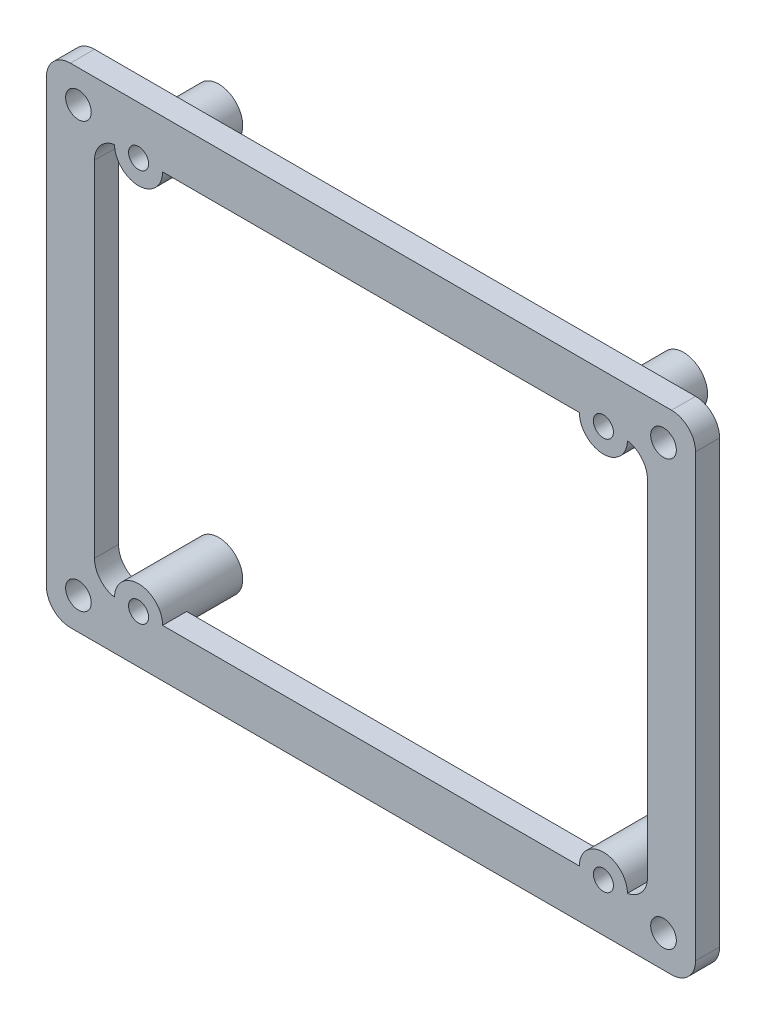
ISO-10303-21;
HEADER;
FILE_DESCRIPTION(('STEP AP214'),'2;1');
FILE_NAME('part.step','',(''),(''),'','','');
FILE_SCHEMA(('AUTOMOTIVE_DESIGN { 1 0 10303 214 1 1 1 1 }'));
ENDSEC;
DATA;
#1=APPLICATION_CONTEXT('core data for automotive mechanical design processes');
#2=APPLICATION_PROTOCOL_DEFINITION('international standard','automotive_design',2000,#1);
#3=PRODUCT_CONTEXT('',#1,'mechanical');
#4=PRODUCT('Part','Part','',(#3));
#5=PRODUCT_RELATED_PRODUCT_CATEGORY('part','',(#4));
#6=PRODUCT_DEFINITION_FORMATION('','',#4);
#7=PRODUCT_DEFINITION_CONTEXT('part definition',#1,'design');
#8=PRODUCT_DEFINITION('design','',#6,#7);
#9=PRODUCT_DEFINITION_SHAPE('','',#8);
#10=(LENGTH_UNIT() NAMED_UNIT(*) SI_UNIT(.MILLI.,.METRE.));
#11=(NAMED_UNIT(*) PLANE_ANGLE_UNIT() SI_UNIT($,.RADIAN.));
#12=(NAMED_UNIT(*) SI_UNIT($,.STERADIAN.) SOLID_ANGLE_UNIT());
#13=UNCERTAINTY_MEASURE_WITH_UNIT(LENGTH_MEASURE(1.E-05),#10,'distance_accuracy_value','');
#14=(GEOMETRIC_REPRESENTATION_CONTEXT(3) GLOBAL_UNCERTAINTY_ASSIGNED_CONTEXT((#13)) GLOBAL_UNIT_ASSIGNED_CONTEXT((#10,
#11,#12)) REPRESENTATION_CONTEXT('',''));
#15=CARTESIAN_POINT('',(0.,0.,0.));
#16=DIRECTION('',(0.,0.,1.));
#17=DIRECTION('',(1.,0.,0.));
#18=AXIS2_PLACEMENT_3D('',#15,#16,#17);
#19=CARTESIAN_POINT('',(0.,0.,3.));
#20=DIRECTION('',(0.,0.,1.));
#21=DIRECTION('',(1.,0.,0.));
#22=AXIS2_PLACEMENT_3D('',#19,#20,#21);
#23=PLANE('',#22);
#24=CARTESIAN_POINT('',(-29.,24.5,3.));
#25=DIRECTION('',(0.,0.,1.));
#26=DIRECTION('',(1.,0.,0.));
#27=AXIS2_PLACEMENT_3D('',#24,#25,#26);
#28=CIRCLE('',#27,1.25);
#29=CARTESIAN_POINT('',(-27.75,24.5,3.));
#30=VERTEX_POINT('',#29);
#31=EDGE_CURVE('E665',#30,#30,#28,.F.);
#32=ORIENTED_EDGE('',*,*,#31,.T.);
#33=EDGE_LOOP('',(#32));
#34=FACE_BOUND('',#33,.T.);
#35=CARTESIAN_POINT('',(29.,-24.5,3.));
#36=DIRECTION('',(0.,0.,1.));
#37=DIRECTION('',(1.,0.,0.));
#38=AXIS2_PLACEMENT_3D('',#35,#36,#37);
#39=CIRCLE('',#38,1.25);
#40=CARTESIAN_POINT('',(30.25,-24.5,3.));
#41=VERTEX_POINT('',#40);
#42=EDGE_CURVE('E666',#41,#41,#39,.F.);
#43=ORIENTED_EDGE('',*,*,#42,.T.);
#44=EDGE_LOOP('',(#43));
#45=FACE_BOUND('',#44,.T.);
#46=CARTESIAN_POINT('',(-29.,-24.5,3.));
#47=DIRECTION('',(0.,0.,1.));
#48=DIRECTION('',(1.,0.,0.));
#49=AXIS2_PLACEMENT_3D('',#46,#47,#48);
#50=CIRCLE('',#49,1.25);
#51=CARTESIAN_POINT('',(-27.75,-24.5,3.));
#52=VERTEX_POINT('',#51);
#53=EDGE_CURVE('E673',#52,#52,#50,.F.);
#54=ORIENTED_EDGE('',*,*,#53,.T.);
#55=EDGE_LOOP('',(#54));
#56=FACE_BOUND('',#55,.T.);
#57=CARTESIAN_POINT('',(29.,24.5,3.));
#58=DIRECTION('',(0.,0.,1.));
#59=DIRECTION('',(1.,0.,0.));
#60=AXIS2_PLACEMENT_3D('',#57,#58,#59);
#61=CIRCLE('',#60,1.25);
#62=CARTESIAN_POINT('',(30.25,24.5,3.));
#63=VERTEX_POINT('',#62);
#64=EDGE_CURVE('E197',#63,#63,#61,.F.);
#65=ORIENTED_EDGE('',*,*,#64,.T.);
#66=EDGE_LOOP('',(#65));
#67=FACE_BOUND('',#66,.T.);
#68=DIRECTION('',(1.,0.,0.));
#69=VECTOR('',#68,1.);
#70=CARTESIAN_POINT('',(0.,-24.5,3.));
#71=LINE('',#70,#69);
#72=CARTESIAN_POINT('',(-26.,-24.5,3.));
#73=VERTEX_POINT('',#72);
#74=CARTESIAN_POINT('',(26.,-24.5,3.));
#75=VERTEX_POINT('',#74);
#76=EDGE_CURVE('E203',#73,#75,#71,.T.);
#77=ORIENTED_EDGE('',*,*,#76,.F.);
#78=CARTESIAN_POINT('',(-29.,-24.5,3.));
#79=DIRECTION('',(0.,0.,1.));
#80=DIRECTION('',(1.,0.,0.));
#81=AXIS2_PLACEMENT_3D('',#78,#79,#80);
#82=CIRCLE('',#81,3.);
#83=CARTESIAN_POINT('',(-31.9997072354643,-24.4580893628869,3.));
#84=VERTEX_POINT('',#83);
#85=EDGE_CURVE('E72',#73,#84,#82,.T.);
#86=ORIENTED_EDGE('',*,*,#85,.T.);
#87=CARTESIAN_POINT('',(-31.5,-21.5,3.));
#88=DIRECTION('',(0.,0.,1.));
#89=DIRECTION('',(1.,0.,0.));
#90=AXIS2_PLACEMENT_3D('',#87,#88,#89);
#91=CIRCLE('',#90,3.);
#92=CARTESIAN_POINT('',(-34.5,-21.5,3.));
#93=VERTEX_POINT('',#92);
#94=EDGE_CURVE('E317',#84,#93,#91,.F.);
#95=ORIENTED_EDGE('',*,*,#94,.T.);
#96=DIRECTION('',(0.,-1.,0.));
#97=VECTOR('',#96,1.);
#98=CARTESIAN_POINT('',(-34.5,0.,3.));
#99=LINE('',#98,#97);
#100=CARTESIAN_POINT('',(-34.5,21.5,3.));
#101=VERTEX_POINT('',#100);
#102=EDGE_CURVE('E213',#101,#93,#99,.T.);
#103=ORIENTED_EDGE('',*,*,#102,.F.);
#104=CARTESIAN_POINT('',(-31.5,21.5,3.));
#105=DIRECTION('',(0.,0.,1.));
#106=DIRECTION('',(1.,0.,0.));
#107=AXIS2_PLACEMENT_3D('',#104,#105,#106);
#108=CIRCLE('',#107,3.);
#109=CARTESIAN_POINT('',(-31.9997072354643,24.4580893628869,3.));
#110=VERTEX_POINT('',#109);
#111=EDGE_CURVE('E321',#101,#110,#108,.F.);
#112=ORIENTED_EDGE('',*,*,#111,.T.);
#113=CARTESIAN_POINT('',(-29.,24.5,3.));
#114=DIRECTION('',(0.,0.,1.));
#115=DIRECTION('',(1.,0.,0.));
#116=AXIS2_PLACEMENT_3D('',#113,#114,#115);
#117=CIRCLE('',#116,3.);
#118=CARTESIAN_POINT('',(-26.,24.5,3.));
#119=VERTEX_POINT('',#118);
#120=EDGE_CURVE('E355',#110,#119,#117,.T.);
#121=ORIENTED_EDGE('',*,*,#120,.T.);
#122=DIRECTION('',(-1.,0.,0.));
#123=VECTOR('',#122,1.);
#124=CARTESIAN_POINT('',(0.,24.5,3.));
#125=LINE('',#124,#123);
#126=CARTESIAN_POINT('',(26.,24.5,3.));
#127=VERTEX_POINT('',#126);
#128=EDGE_CURVE('E216',#127,#119,#125,.T.);
#129=ORIENTED_EDGE('',*,*,#128,.F.);
#130=CARTESIAN_POINT('',(29.,24.5,3.));
#131=DIRECTION('',(0.,0.,1.));
#132=DIRECTION('',(1.,0.,0.));
#133=AXIS2_PLACEMENT_3D('',#130,#131,#132);
#134=CIRCLE('',#133,3.);
#135=CARTESIAN_POINT('',(31.9997072354643,24.4580893628869,3.));
#136=VERTEX_POINT('',#135);
#137=EDGE_CURVE('E79',#127,#136,#134,.T.);
#138=ORIENTED_EDGE('',*,*,#137,.T.);
#139=CARTESIAN_POINT('',(31.5,21.5,3.));
#140=DIRECTION('',(0.,0.,1.));
#141=DIRECTION('',(1.,0.,0.));
#142=AXIS2_PLACEMENT_3D('',#139,#140,#141);
#143=CIRCLE('',#142,3.);
#144=CARTESIAN_POINT('',(34.5,21.5,3.));
#145=VERTEX_POINT('',#144);
#146=EDGE_CURVE('E312',#136,#145,#143,.F.);
#147=ORIENTED_EDGE('',*,*,#146,.T.);
#148=DIRECTION('',(0.,1.,0.));
#149=VECTOR('',#148,1.);
#150=CARTESIAN_POINT('',(34.5,0.,3.));
#151=LINE('',#150,#149);
#152=CARTESIAN_POINT('',(34.5,-21.5,3.));
#153=VERTEX_POINT('',#152);
#154=EDGE_CURVE('E212',#153,#145,#151,.T.);
#155=ORIENTED_EDGE('',*,*,#154,.F.);
#156=CARTESIAN_POINT('',(31.5,-21.5,3.));
#157=DIRECTION('',(0.,0.,1.));
#158=DIRECTION('',(1.,0.,0.));
#159=AXIS2_PLACEMENT_3D('',#156,#157,#158);
#160=CIRCLE('',#159,3.);
#161=CARTESIAN_POINT('',(31.9997072354643,-24.4580893628869,3.));
#162=VERTEX_POINT('',#161);
#163=EDGE_CURVE('E307',#153,#162,#160,.F.);
#164=ORIENTED_EDGE('',*,*,#163,.T.);
#165=CARTESIAN_POINT('',(29.,-24.5,3.));
#166=DIRECTION('',(0.,0.,1.));
#167=DIRECTION('',(1.,0.,0.));
#168=AXIS2_PLACEMENT_3D('',#165,#166,#167);
#169=CIRCLE('',#168,3.);
#170=EDGE_CURVE('E206',#162,#75,#169,.T.);
#171=ORIENTED_EDGE('',*,*,#170,.T.);
#172=EDGE_LOOP('',(#77,#86,#95,#103,#112,#121,#129,#138,#147,#155,#164,#171));
#173=FACE_BOUND('',#172,.T.);
#174=CARTESIAN_POINT('',(-36.5,-26.5,3.));
#175=DIRECTION('',(0.,0.,1.));
#176=DIRECTION('',(1.,0.,0.));
#177=AXIS2_PLACEMENT_3D('',#174,#175,#176);
#178=CIRCLE('',#177,1.6);
#179=CARTESIAN_POINT('',(-34.9,-26.5,3.));
#180=VERTEX_POINT('',#179);
#181=EDGE_CURVE('E378',#180,#180,#178,.T.);
#182=ORIENTED_EDGE('',*,*,#181,.F.);
#183=EDGE_LOOP('',(#182));
#184=FACE_BOUND('',#183,.T.);
#185=CARTESIAN_POINT('',(36.5,-26.5,3.));
#186=DIRECTION('',(0.,0.,1.));
#187=DIRECTION('',(1.,0.,0.));
#188=AXIS2_PLACEMENT_3D('',#185,#186,#187);
#189=CIRCLE('',#188,1.6);
#190=CARTESIAN_POINT('',(38.1,-26.5,3.));
#191=VERTEX_POINT('',#190);
#192=EDGE_CURVE('E387',#191,#191,#189,.T.);
#193=ORIENTED_EDGE('',*,*,#192,.F.);
#194=EDGE_LOOP('',(#193));
#195=FACE_BOUND('',#194,.T.);
#196=CARTESIAN_POINT('',(36.5,26.5,3.));
#197=DIRECTION('',(0.,0.,1.));
#198=DIRECTION('',(1.,0.,0.));
#199=AXIS2_PLACEMENT_3D('',#196,#197,#198);
#200=CIRCLE('',#199,1.6);
#201=CARTESIAN_POINT('',(38.1,26.5,3.));
#202=VERTEX_POINT('',#201);
#203=EDGE_CURVE('E379',#202,#202,#200,.T.);
#204=ORIENTED_EDGE('',*,*,#203,.F.);
#205=EDGE_LOOP('',(#204));
#206=FACE_BOUND('',#205,.T.);
#207=CARTESIAN_POINT('',(-36.5,26.5,3.));
#208=DIRECTION('',(0.,0.,1.));
#209=DIRECTION('',(1.,0.,0.));
#210=AXIS2_PLACEMENT_3D('',#207,#208,#209);
#211=CIRCLE('',#210,1.6);
#212=CARTESIAN_POINT('',(-34.9,26.5,3.));
#213=VERTEX_POINT('',#212);
#214=EDGE_CURVE('E386',#213,#213,#211,.T.);
#215=ORIENTED_EDGE('',*,*,#214,.F.);
#216=EDGE_LOOP('',(#215));
#217=FACE_BOUND('',#216,.T.);
#218=DIRECTION('',(0.,1.,0.));
#219=VECTOR('',#218,1.);
#220=CARTESIAN_POINT('',(40.5,0.,3.));
#221=LINE('',#220,#219);
#222=CARTESIAN_POINT('',(40.5,-27.5,3.));
#223=VERTEX_POINT('',#222);
#224=CARTESIAN_POINT('',(40.5,27.5,3.));
#225=VERTEX_POINT('',#224);
#226=EDGE_CURVE('E243',#223,#225,#221,.T.);
#227=ORIENTED_EDGE('',*,*,#226,.T.);
#228=CARTESIAN_POINT('',(37.5,27.5,3.));
#229=DIRECTION('',(0.,0.,1.));
#230=DIRECTION('',(1.,0.,0.));
#231=AXIS2_PLACEMENT_3D('',#228,#229,#230);
#232=CIRCLE('',#231,3.);
#233=CARTESIAN_POINT('',(37.5,30.5,3.));
#234=VERTEX_POINT('',#233);
#235=EDGE_CURVE('E293',#225,#234,#232,.T.);
#236=ORIENTED_EDGE('',*,*,#235,.T.);
#237=DIRECTION('',(-1.,0.,0.));
#238=VECTOR('',#237,1.);
#239=CARTESIAN_POINT('',(0.,30.5,3.));
#240=LINE('',#239,#238);
#241=CARTESIAN_POINT('',(-37.5,30.5,3.));
#242=VERTEX_POINT('',#241);
#243=EDGE_CURVE('E246',#234,#242,#240,.T.);
#244=ORIENTED_EDGE('',*,*,#243,.T.);
#245=CARTESIAN_POINT('',(-37.5,27.5,3.));
#246=DIRECTION('',(0.,0.,1.));
#247=DIRECTION('',(1.,0.,0.));
#248=AXIS2_PLACEMENT_3D('',#245,#246,#247);
#249=CIRCLE('',#248,3.);
#250=CARTESIAN_POINT('',(-40.5,27.5,3.));
#251=VERTEX_POINT('',#250);
#252=EDGE_CURVE('E287',#242,#251,#249,.T.);
#253=ORIENTED_EDGE('',*,*,#252,.T.);
#254=DIRECTION('',(0.,-1.,0.));
#255=VECTOR('',#254,1.);
#256=CARTESIAN_POINT('',(-40.5,0.,3.));
#257=LINE('',#256,#255);
#258=CARTESIAN_POINT('',(-40.5,-27.5,3.));
#259=VERTEX_POINT('',#258);
#260=EDGE_CURVE('E236',#251,#259,#257,.T.);
#261=ORIENTED_EDGE('',*,*,#260,.T.);
#262=CARTESIAN_POINT('',(-37.5,-27.5,3.));
#263=DIRECTION('',(0.,0.,1.));
#264=DIRECTION('',(1.,0.,0.));
#265=AXIS2_PLACEMENT_3D('',#262,#263,#264);
#266=CIRCLE('',#265,3.);
#267=CARTESIAN_POINT('',(-37.5,-30.5,3.));
#268=VERTEX_POINT('',#267);
#269=EDGE_CURVE('E289',#259,#268,#266,.T.);
#270=ORIENTED_EDGE('',*,*,#269,.T.);
#271=DIRECTION('',(1.,0.,0.));
#272=VECTOR('',#271,1.);
#273=CARTESIAN_POINT('',(0.,-30.5,3.));
#274=LINE('',#273,#272);
#275=CARTESIAN_POINT('',(37.5,-30.5,3.));
#276=VERTEX_POINT('',#275);
#277=EDGE_CURVE('E239',#268,#276,#274,.T.);
#278=ORIENTED_EDGE('',*,*,#277,.T.);
#279=CARTESIAN_POINT('',(37.5,-27.5,3.));
#280=DIRECTION('',(0.,0.,1.));
#281=DIRECTION('',(1.,0.,0.));
#282=AXIS2_PLACEMENT_3D('',#279,#280,#281);
#283=CIRCLE('',#282,3.);
#284=EDGE_CURVE('E291',#276,#223,#283,.T.);
#285=ORIENTED_EDGE('',*,*,#284,.T.);
#286=EDGE_LOOP('',(#227,#236,#244,#253,#261,#270,#278,#285));
#287=FACE_BOUND('',#286,.T.);
#288=ADVANCED_FACE('F57',(#34,#45,#56,#67,#173,#184,#195,#206,#217,#287),#23,.T.);
#289=CARTESIAN_POINT('',(0.,0.,0.));
#290=DIRECTION('',(0.,0.,1.));
#291=DIRECTION('',(1.,0.,0.));
#292=AXIS2_PLACEMENT_3D('',#289,#290,#291);
#293=PLANE('',#292);
#294=CARTESIAN_POINT('',(-36.5,-26.5,0.));
#295=DIRECTION('',(0.,0.,1.));
#296=DIRECTION('',(1.,0.,0.));
#297=AXIS2_PLACEMENT_3D('',#294,#295,#296);
#298=CIRCLE('',#297,1.6);
#299=CARTESIAN_POINT('',(-34.9,-26.5,0.));
#300=VERTEX_POINT('',#299);
#301=EDGE_CURVE('E390',#300,#300,#298,.F.);
#302=ORIENTED_EDGE('',*,*,#301,.F.);
#303=EDGE_LOOP('',(#302));
#304=FACE_BOUND('',#303,.T.);
#305=CARTESIAN_POINT('',(36.5,-26.5,0.));
#306=DIRECTION('',(0.,0.,1.));
#307=DIRECTION('',(1.,0.,0.));
#308=AXIS2_PLACEMENT_3D('',#305,#306,#307);
#309=CIRCLE('',#308,1.6);
#310=CARTESIAN_POINT('',(38.1,-26.5,0.));
#311=VERTEX_POINT('',#310);
#312=EDGE_CURVE('E383',#311,#311,#309,.F.);
#313=ORIENTED_EDGE('',*,*,#312,.F.);
#314=EDGE_LOOP('',(#313));
#315=FACE_BOUND('',#314,.T.);
#316=CARTESIAN_POINT('',(36.5,26.5,0.));
#317=DIRECTION('',(0.,0.,1.));
#318=DIRECTION('',(1.,0.,0.));
#319=AXIS2_PLACEMENT_3D('',#316,#317,#318);
#320=CIRCLE('',#319,1.6);
#321=CARTESIAN_POINT('',(38.1,26.5,0.));
#322=VERTEX_POINT('',#321);
#323=EDGE_CURVE('E382',#322,#322,#320,.F.);
#324=ORIENTED_EDGE('',*,*,#323,.F.);
#325=EDGE_LOOP('',(#324));
#326=FACE_BOUND('',#325,.T.);
#327=CARTESIAN_POINT('',(-36.5,26.5,0.));
#328=DIRECTION('',(0.,0.,1.));
#329=DIRECTION('',(1.,0.,0.));
#330=AXIS2_PLACEMENT_3D('',#327,#328,#329);
#331=CIRCLE('',#330,1.6);
#332=CARTESIAN_POINT('',(-34.9,26.5,0.));
#333=VERTEX_POINT('',#332);
#334=EDGE_CURVE('E229',#333,#333,#331,.F.);
#335=ORIENTED_EDGE('',*,*,#334,.F.);
#336=EDGE_LOOP('',(#335));
#337=FACE_BOUND('',#336,.T.);
#338=DIRECTION('',(-1.,0.,0.));
#339=VECTOR('',#338,1.);
#340=CARTESIAN_POINT('',(0.,30.5,0.));
#341=LINE('',#340,#339);
#342=CARTESIAN_POINT('',(37.5,30.5,0.));
#343=VERTEX_POINT('',#342);
#344=CARTESIAN_POINT('',(-37.5,30.5,0.));
#345=VERTEX_POINT('',#344);
#346=EDGE_CURVE('E240',#343,#345,#341,.T.);
#347=ORIENTED_EDGE('',*,*,#346,.F.);
#348=CARTESIAN_POINT('',(37.5,27.5,0.));
#349=DIRECTION('',(0.,0.,1.));
#350=DIRECTION('',(1.,0.,0.));
#351=AXIS2_PLACEMENT_3D('',#348,#349,#350);
#352=CIRCLE('',#351,3.);
#353=CARTESIAN_POINT('',(40.5,27.5,0.));
#354=VERTEX_POINT('',#353);
#355=EDGE_CURVE('E280',#343,#354,#352,.F.);
#356=ORIENTED_EDGE('',*,*,#355,.T.);
#357=DIRECTION('',(0.,1.,0.));
#358=VECTOR('',#357,1.);
#359=CARTESIAN_POINT('',(40.5,0.,0.));
#360=LINE('',#359,#358);
#361=CARTESIAN_POINT('',(40.5,-27.5,0.));
#362=VERTEX_POINT('',#361);
#363=EDGE_CURVE('E255',#362,#354,#360,.T.);
#364=ORIENTED_EDGE('',*,*,#363,.F.);
#365=CARTESIAN_POINT('',(37.5,-27.5,0.));
#366=DIRECTION('',(0.,0.,1.));
#367=DIRECTION('',(1.,0.,0.));
#368=AXIS2_PLACEMENT_3D('',#365,#366,#367);
#369=CIRCLE('',#368,3.);
#370=CARTESIAN_POINT('',(37.5,-30.5,0.));
#371=VERTEX_POINT('',#370);
#372=EDGE_CURVE('E278',#362,#371,#369,.F.);
#373=ORIENTED_EDGE('',*,*,#372,.T.);
#374=DIRECTION('',(1.,0.,0.));
#375=VECTOR('',#374,1.);
#376=CARTESIAN_POINT('',(0.,-30.5,0.));
#377=LINE('',#376,#375);
#378=CARTESIAN_POINT('',(-37.5,-30.5,0.));
#379=VERTEX_POINT('',#378);
#380=EDGE_CURVE('E252',#379,#371,#377,.T.);
#381=ORIENTED_EDGE('',*,*,#380,.F.);
#382=CARTESIAN_POINT('',(-37.5,-27.5,0.));
#383=DIRECTION('',(0.,0.,1.));
#384=DIRECTION('',(1.,0.,0.));
#385=AXIS2_PLACEMENT_3D('',#382,#383,#384);
#386=CIRCLE('',#385,3.);
#387=CARTESIAN_POINT('',(-40.5,-27.5,0.));
#388=VERTEX_POINT('',#387);
#389=EDGE_CURVE('E276',#379,#388,#386,.F.);
#390=ORIENTED_EDGE('',*,*,#389,.T.);
#391=DIRECTION('',(0.,-1.,0.));
#392=VECTOR('',#391,1.);
#393=CARTESIAN_POINT('',(-40.5,0.,0.));
#394=LINE('',#393,#392);
#395=CARTESIAN_POINT('',(-40.5,27.5,0.));
#396=VERTEX_POINT('',#395);
#397=EDGE_CURVE('E225',#396,#388,#394,.T.);
#398=ORIENTED_EDGE('',*,*,#397,.F.);
#399=CARTESIAN_POINT('',(-37.5,27.5,0.));
#400=DIRECTION('',(0.,0.,1.));
#401=DIRECTION('',(1.,0.,0.));
#402=AXIS2_PLACEMENT_3D('',#399,#400,#401);
#403=CIRCLE('',#402,3.);
#404=EDGE_CURVE('E274',#396,#345,#403,.F.);
#405=ORIENTED_EDGE('',*,*,#404,.T.);
#406=EDGE_LOOP('',(#347,#356,#364,#373,#381,#390,#398,#405));
#407=FACE_BOUND('',#406,.T.);
#408=CARTESIAN_POINT('',(-31.5,-21.5,0.));
#409=DIRECTION('',(0.,0.,1.));
#410=DIRECTION('',(1.,0.,0.));
#411=AXIS2_PLACEMENT_3D('',#408,#409,#410);
#412=CIRCLE('',#411,3.);
#413=CARTESIAN_POINT('',(-34.5,-21.5,0.));
#414=VERTEX_POINT('',#413);
#415=CARTESIAN_POINT('',(-31.9997072354643,-24.4580893628869,0.));
#416=VERTEX_POINT('',#415);
#417=EDGE_CURVE('E314',#414,#416,#412,.T.);
#418=ORIENTED_EDGE('',*,*,#417,.T.);
#419=CARTESIAN_POINT('',(-29.,-24.5,0.));
#420=DIRECTION('',(0.,0.,1.));
#421=DIRECTION('',(1.,0.,0.));
#422=AXIS2_PLACEMENT_3D('',#419,#420,#421);
#423=CIRCLE('',#422,3.);
#424=CARTESIAN_POINT('',(-26.,-24.5,0.));
#425=VERTEX_POINT('',#424);
#426=EDGE_CURVE('E207',#416,#425,#423,.T.);
#427=ORIENTED_EDGE('',*,*,#426,.T.);
#428=DIRECTION('',(1.,0.,0.));
#429=VECTOR('',#428,1.);
#430=CARTESIAN_POINT('',(0.,-24.5,0.));
#431=LINE('',#430,#429);
#432=CARTESIAN_POINT('',(26.,-24.5,0.));
#433=VERTEX_POINT('',#432);
#434=EDGE_CURVE('E205',#425,#433,#431,.T.);
#435=ORIENTED_EDGE('',*,*,#434,.T.);
#436=CARTESIAN_POINT('',(29.,-24.5,0.));
#437=DIRECTION('',(0.,0.,1.));
#438=DIRECTION('',(1.,0.,0.));
#439=AXIS2_PLACEMENT_3D('',#436,#437,#438);
#440=CIRCLE('',#439,3.);
#441=CARTESIAN_POINT('',(31.9997072354643,-24.4580893628869,0.));
#442=VERTEX_POINT('',#441);
#443=EDGE_CURVE('E351',#433,#442,#440,.T.);
#444=ORIENTED_EDGE('',*,*,#443,.T.);
#445=CARTESIAN_POINT('',(31.5,-21.5,0.));
#446=DIRECTION('',(0.,0.,1.));
#447=DIRECTION('',(1.,0.,0.));
#448=AXIS2_PLACEMENT_3D('',#445,#446,#447);
#449=CIRCLE('',#448,3.);
#450=CARTESIAN_POINT('',(34.5,-21.5,0.));
#451=VERTEX_POINT('',#450);
#452=EDGE_CURVE('E305',#442,#451,#449,.T.);
#453=ORIENTED_EDGE('',*,*,#452,.T.);
#454=DIRECTION('',(0.,1.,0.));
#455=VECTOR('',#454,1.);
#456=CARTESIAN_POINT('',(34.5,0.,0.));
#457=LINE('',#456,#455);
#458=CARTESIAN_POINT('',(34.5,21.5,0.));
#459=VERTEX_POINT('',#458);
#460=EDGE_CURVE('E231',#451,#459,#457,.T.);
#461=ORIENTED_EDGE('',*,*,#460,.T.);
#462=CARTESIAN_POINT('',(31.5,21.5,0.));
#463=DIRECTION('',(0.,0.,1.));
#464=DIRECTION('',(1.,0.,0.));
#465=AXIS2_PLACEMENT_3D('',#462,#463,#464);
#466=CIRCLE('',#465,3.);
#467=CARTESIAN_POINT('',(31.9997072354643,24.4580893628869,0.));
#468=VERTEX_POINT('',#467);
#469=EDGE_CURVE('E309',#459,#468,#466,.T.);
#470=ORIENTED_EDGE('',*,*,#469,.T.);
#471=CARTESIAN_POINT('',(29.,24.5,0.));
#472=DIRECTION('',(0.,0.,1.));
#473=DIRECTION('',(1.,0.,0.));
#474=AXIS2_PLACEMENT_3D('',#471,#472,#473);
#475=CIRCLE('',#474,3.);
#476=CARTESIAN_POINT('',(26.,24.5,0.));
#477=VERTEX_POINT('',#476);
#478=EDGE_CURVE('E349',#468,#477,#475,.T.);
#479=ORIENTED_EDGE('',*,*,#478,.T.);
#480=DIRECTION('',(-1.,0.,0.));
#481=VECTOR('',#480,1.);
#482=CARTESIAN_POINT('',(0.,24.5,0.));
#483=LINE('',#482,#481);
#484=CARTESIAN_POINT('',(-26.,24.5,0.));
#485=VERTEX_POINT('',#484);
#486=EDGE_CURVE('E219',#477,#485,#483,.T.);
#487=ORIENTED_EDGE('',*,*,#486,.T.);
#488=CARTESIAN_POINT('',(-29.,24.5,0.));
#489=DIRECTION('',(0.,0.,1.));
#490=DIRECTION('',(1.,0.,0.));
#491=AXIS2_PLACEMENT_3D('',#488,#489,#490);
#492=CIRCLE('',#491,3.);
#493=CARTESIAN_POINT('',(-31.9997072354643,24.4580893628869,0.));
#494=VERTEX_POINT('',#493);
#495=EDGE_CURVE('E364',#485,#494,#492,.T.);
#496=ORIENTED_EDGE('',*,*,#495,.T.);
#497=CARTESIAN_POINT('',(-31.5,21.5,0.));
#498=DIRECTION('',(0.,0.,1.));
#499=DIRECTION('',(1.,0.,0.));
#500=AXIS2_PLACEMENT_3D('',#497,#498,#499);
#501=CIRCLE('',#500,3.);
#502=CARTESIAN_POINT('',(-34.5,21.5,0.));
#503=VERTEX_POINT('',#502);
#504=EDGE_CURVE('E319',#494,#503,#501,.T.);
#505=ORIENTED_EDGE('',*,*,#504,.T.);
#506=DIRECTION('',(0.,-1.,0.));
#507=VECTOR('',#506,1.);
#508=CARTESIAN_POINT('',(-34.5,0.,0.));
#509=LINE('',#508,#507);
#510=EDGE_CURVE('E226',#503,#414,#509,.T.);
#511=ORIENTED_EDGE('',*,*,#510,.T.);
#512=EDGE_LOOP('',(#418,#427,#435,#444,#453,#461,#470,#479,#487,#496,#505,#511));
#513=FACE_BOUND('',#512,.T.);
#514=ADVANCED_FACE('F348',(#304,#315,#326,#337,#407,#513),#293,.F.);
#515=CARTESIAN_POINT('',(-40.5,0.,3.));
#516=DIRECTION('',(1.,0.,0.));
#517=DIRECTION('',(0.,1.,0.));
#518=AXIS2_PLACEMENT_3D('',#515,#516,#517);
#519=PLANE('',#518);
#520=ORIENTED_EDGE('',*,*,#397,.T.);
#521=DIRECTION('',(0.,0.,-1.));
#522=VECTOR('',#521,1.);
#523=CARTESIAN_POINT('',(-40.5,-27.5,3.));
#524=LINE('',#523,#522);
#525=EDGE_CURVE('E303',#388,#259,#524,.F.);
#526=ORIENTED_EDGE('',*,*,#525,.T.);
#527=ORIENTED_EDGE('',*,*,#260,.F.);
#528=DIRECTION('',(0.,0.,-1.));
#529=VECTOR('',#528,1.);
#530=CARTESIAN_POINT('',(-40.5,27.5,3.));
#531=LINE('',#530,#529);
#532=EDGE_CURVE('E300',#251,#396,#531,.T.);
#533=ORIENTED_EDGE('',*,*,#532,.T.);
#534=EDGE_LOOP('',(#520,#526,#527,#533));
#535=FACE_BOUND('',#534,.T.);
#536=ADVANCED_FACE('F406',(#535),#519,.F.);
#537=CARTESIAN_POINT('',(0.,-30.5,3.));
#538=DIRECTION('',(0.,1.,0.));
#539=DIRECTION('',(-1.,0.,0.));
#540=AXIS2_PLACEMENT_3D('',#537,#538,#539);
#541=PLANE('',#540);
#542=ORIENTED_EDGE('',*,*,#380,.T.);
#543=DIRECTION('',(0.,0.,-1.));
#544=VECTOR('',#543,1.);
#545=CARTESIAN_POINT('',(37.5,-30.5,3.));
#546=LINE('',#545,#544);
#547=EDGE_CURVE('E298',#371,#276,#546,.F.);
#548=ORIENTED_EDGE('',*,*,#547,.T.);
#549=ORIENTED_EDGE('',*,*,#277,.F.);
#550=DIRECTION('',(0.,0.,-1.));
#551=VECTOR('',#550,1.);
#552=CARTESIAN_POINT('',(-37.5,-30.5,3.));
#553=LINE('',#552,#551);
#554=EDGE_CURVE('E295',#268,#379,#553,.T.);
#555=ORIENTED_EDGE('',*,*,#554,.T.);
#556=EDGE_LOOP('',(#542,#548,#549,#555));
#557=FACE_BOUND('',#556,.T.);
#558=ADVANCED_FACE('F432',(#557),#541,.F.);
#559=CARTESIAN_POINT('',(40.5,0.,3.));
#560=DIRECTION('',(-1.,0.,0.));
#561=DIRECTION('',(0.,-1.,0.));
#562=AXIS2_PLACEMENT_3D('',#559,#560,#561);
#563=PLANE('',#562);
#564=ORIENTED_EDGE('',*,*,#363,.T.);
#565=DIRECTION('',(0.,0.,-1.));
#566=VECTOR('',#565,1.);
#567=CARTESIAN_POINT('',(40.5,27.5,3.));
#568=LINE('',#567,#566);
#569=EDGE_CURVE('E285',#354,#225,#568,.F.);
#570=ORIENTED_EDGE('',*,*,#569,.T.);
#571=ORIENTED_EDGE('',*,*,#226,.F.);
#572=DIRECTION('',(0.,0.,-1.));
#573=VECTOR('',#572,1.);
#574=CARTESIAN_POINT('',(40.5,-27.5,3.));
#575=LINE('',#574,#573);
#576=EDGE_CURVE('E282',#223,#362,#575,.T.);
#577=ORIENTED_EDGE('',*,*,#576,.T.);
#578=EDGE_LOOP('',(#564,#570,#571,#577));
#579=FACE_BOUND('',#578,.T.);
#580=ADVANCED_FACE('F441',(#579),#563,.F.);
#581=CARTESIAN_POINT('',(0.,30.5,3.));
#582=DIRECTION('',(0.,-1.,0.));
#583=DIRECTION('',(1.,0.,0.));
#584=AXIS2_PLACEMENT_3D('',#581,#582,#583);
#585=PLANE('',#584);
#586=ORIENTED_EDGE('',*,*,#243,.F.);
#587=DIRECTION('',(0.,0.,-1.));
#588=VECTOR('',#587,1.);
#589=CARTESIAN_POINT('',(37.5,30.5,3.));
#590=LINE('',#589,#588);
#591=EDGE_CURVE('E271',#234,#343,#590,.T.);
#592=ORIENTED_EDGE('',*,*,#591,.T.);
#593=ORIENTED_EDGE('',*,*,#346,.T.);
#594=DIRECTION('',(0.,0.,-1.));
#595=VECTOR('',#594,1.);
#596=CARTESIAN_POINT('',(-37.5,30.5,3.));
#597=LINE('',#596,#595);
#598=EDGE_CURVE('E269',#345,#242,#597,.F.);
#599=ORIENTED_EDGE('',*,*,#598,.T.);
#600=EDGE_LOOP('',(#586,#592,#593,#599));
#601=FACE_BOUND('',#600,.T.);
#602=ADVANCED_FACE('F415',(#601),#585,.F.);
#603=CARTESIAN_POINT('',(-34.5,0.,3.));
#604=DIRECTION('',(1.,0.,0.));
#605=DIRECTION('',(0.,1.,0.));
#606=AXIS2_PLACEMENT_3D('',#603,#604,#605);
#607=PLANE('',#606);
#608=ORIENTED_EDGE('',*,*,#102,.T.);
#609=DIRECTION('',(0.,0.,-1.));
#610=VECTOR('',#609,1.);
#611=CARTESIAN_POINT('',(-34.5,-21.5,0.));
#612=LINE('',#611,#610);
#613=EDGE_CURVE('E266',#93,#414,#612,.T.);
#614=ORIENTED_EDGE('',*,*,#613,.T.);
#615=ORIENTED_EDGE('',*,*,#510,.F.);
#616=DIRECTION('',(0.,0.,-1.));
#617=VECTOR('',#616,1.);
#618=CARTESIAN_POINT('',(-34.5,21.5,3.));
#619=LINE('',#618,#617);
#620=EDGE_CURVE('E264',#503,#101,#619,.F.);
#621=ORIENTED_EDGE('',*,*,#620,.T.);
#622=EDGE_LOOP('',(#608,#614,#615,#621));
#623=FACE_BOUND('',#622,.T.);
#624=ADVANCED_FACE('F466',(#623),#607,.T.);
#625=CARTESIAN_POINT('',(0.,-24.5,3.));
#626=DIRECTION('',(0.,1.,0.));
#627=DIRECTION('',(-1.,0.,0.));
#628=AXIS2_PLACEMENT_3D('',#625,#626,#627);
#629=PLANE('',#628);
#630=DIRECTION('',(0.,0.,1.));
#631=VECTOR('',#630,1.);
#632=CARTESIAN_POINT('',(-26.,-24.5,-7.));
#633=LINE('',#632,#631);
#634=EDGE_CURVE('E193',#73,#425,#633,.F.);
#635=ORIENTED_EDGE('',*,*,#634,.F.);
#636=ORIENTED_EDGE('',*,*,#76,.T.);
#637=DIRECTION('',(0.,0.,1.));
#638=VECTOR('',#637,1.);
#639=CARTESIAN_POINT('',(26.,-24.5,-7.));
#640=LINE('',#639,#638);
#641=EDGE_CURVE('E352',#433,#75,#640,.T.);
#642=ORIENTED_EDGE('',*,*,#641,.F.);
#643=ORIENTED_EDGE('',*,*,#434,.F.);
#644=EDGE_LOOP('',(#635,#636,#642,#643));
#645=FACE_BOUND('',#644,.T.);
#646=ADVANCED_FACE('F201',(#645),#629,.T.);
#647=CARTESIAN_POINT('',(34.5,0.,3.));
#648=DIRECTION('',(-1.,0.,0.));
#649=DIRECTION('',(0.,-1.,0.));
#650=AXIS2_PLACEMENT_3D('',#647,#648,#649);
#651=PLANE('',#650);
#652=ORIENTED_EDGE('',*,*,#460,.F.);
#653=DIRECTION('',(0.,0.,-1.));
#654=VECTOR('',#653,1.);
#655=CARTESIAN_POINT('',(34.5,-21.5,3.));
#656=LINE('',#655,#654);
#657=EDGE_CURVE('E262',#451,#153,#656,.F.);
#658=ORIENTED_EDGE('',*,*,#657,.T.);
#659=ORIENTED_EDGE('',*,*,#154,.T.);
#660=DIRECTION('',(0.,0.,-1.));
#661=VECTOR('',#660,1.);
#662=CARTESIAN_POINT('',(34.5,21.5,0.));
#663=LINE('',#662,#661);
#664=EDGE_CURVE('E249',#145,#459,#663,.T.);
#665=ORIENTED_EDGE('',*,*,#664,.T.);
#666=EDGE_LOOP('',(#652,#658,#659,#665));
#667=FACE_BOUND('',#666,.T.);
#668=ADVANCED_FACE('F343',(#667),#651,.T.);
#669=CARTESIAN_POINT('',(0.,24.5,3.));
#670=DIRECTION('',(0.,-1.,0.));
#671=DIRECTION('',(1.,0.,0.));
#672=AXIS2_PLACEMENT_3D('',#669,#670,#671);
#673=PLANE('',#672);
#674=DIRECTION('',(0.,0.,1.));
#675=VECTOR('',#674,1.);
#676=CARTESIAN_POINT('',(-26.,24.5,-7.));
#677=LINE('',#676,#675);
#678=EDGE_CURVE('E369',#485,#119,#677,.T.);
#679=ORIENTED_EDGE('',*,*,#678,.F.);
#680=ORIENTED_EDGE('',*,*,#486,.F.);
#681=DIRECTION('',(0.,0.,1.));
#682=VECTOR('',#681,1.);
#683=CARTESIAN_POINT('',(26.,24.5,-7.));
#684=LINE('',#683,#682);
#685=EDGE_CURVE('E376',#127,#477,#684,.F.);
#686=ORIENTED_EDGE('',*,*,#685,.F.);
#687=ORIENTED_EDGE('',*,*,#128,.T.);
#688=EDGE_LOOP('',(#679,#680,#686,#687));
#689=FACE_BOUND('',#688,.T.);
#690=ADVANCED_FACE('F636',(#689),#673,.T.);
#691=CARTESIAN_POINT('',(-36.5,26.5,-4.5254833995939));
#692=DIRECTION('',(0.,0.,1.));
#693=DIRECTION('',(1.,0.,0.));
#694=AXIS2_PLACEMENT_3D('',#691,#692,#693);
#695=CYLINDRICAL_SURFACE('',#694,1.6);
#696=ORIENTED_EDGE('',*,*,#334,.T.);
#697=EDGE_LOOP('',(#696));
#698=FACE_BOUND('',#697,.T.);
#699=ORIENTED_EDGE('',*,*,#214,.T.);
#700=EDGE_LOOP('',(#699));
#701=FACE_BOUND('',#700,.T.);
#702=ADVANCED_FACE('F401',(#698,#701),#695,.F.);
#703=CARTESIAN_POINT('',(36.5,26.5,-4.5254833995939));
#704=DIRECTION('',(0.,0.,1.));
#705=DIRECTION('',(1.,0.,0.));
#706=AXIS2_PLACEMENT_3D('',#703,#704,#705);
#707=CYLINDRICAL_SURFACE('',#706,1.6);
#708=ORIENTED_EDGE('',*,*,#323,.T.);
#709=EDGE_LOOP('',(#708));
#710=FACE_BOUND('',#709,.T.);
#711=ORIENTED_EDGE('',*,*,#203,.T.);
#712=EDGE_LOOP('',(#711));
#713=FACE_BOUND('',#712,.T.);
#714=ADVANCED_FACE('F623',(#710,#713),#707,.F.);
#715=CARTESIAN_POINT('',(36.5,-26.5,-4.5254833995939));
#716=DIRECTION('',(0.,0.,1.));
#717=DIRECTION('',(1.,0.,0.));
#718=AXIS2_PLACEMENT_3D('',#715,#716,#717);
#719=CYLINDRICAL_SURFACE('',#718,1.6);
#720=ORIENTED_EDGE('',*,*,#312,.T.);
#721=EDGE_LOOP('',(#720));
#722=FACE_BOUND('',#721,.T.);
#723=ORIENTED_EDGE('',*,*,#192,.T.);
#724=EDGE_LOOP('',(#723));
#725=FACE_BOUND('',#724,.T.);
#726=ADVANCED_FACE('F626',(#722,#725),#719,.F.);
#727=CARTESIAN_POINT('',(-36.5,-26.5,-4.5254833995939));
#728=DIRECTION('',(0.,0.,1.));
#729=DIRECTION('',(1.,0.,0.));
#730=AXIS2_PLACEMENT_3D('',#727,#728,#729);
#731=CYLINDRICAL_SURFACE('',#730,1.6);
#732=ORIENTED_EDGE('',*,*,#301,.T.);
#733=EDGE_LOOP('',(#732));
#734=FACE_BOUND('',#733,.T.);
#735=ORIENTED_EDGE('',*,*,#181,.T.);
#736=EDGE_LOOP('',(#735));
#737=FACE_BOUND('',#736,.T.);
#738=ADVANCED_FACE('F479',(#734,#737),#731,.F.);
#739=CARTESIAN_POINT('',(31.5,-21.5,3.));
#740=DIRECTION('',(0.,0.,1.));
#741=DIRECTION('',(1.,0.,0.));
#742=AXIS2_PLACEMENT_3D('',#739,#740,#741);
#743=CYLINDRICAL_SURFACE('',#742,3.);
#744=ORIENTED_EDGE('',*,*,#452,.F.);
#745=DIRECTION('',(0.,0.,1.));
#746=VECTOR('',#745,1.);
#747=CARTESIAN_POINT('',(31.9997072354643,-24.4580893628869,-2.));
#748=LINE('',#747,#746);
#749=EDGE_CURVE('E65',#442,#162,#748,.T.);
#750=ORIENTED_EDGE('',*,*,#749,.T.);
#751=ORIENTED_EDGE('',*,*,#163,.F.);
#752=ORIENTED_EDGE('',*,*,#657,.F.);
#753=EDGE_LOOP('',(#744,#750,#751,#752));
#754=FACE_BOUND('',#753,.T.);
#755=ADVANCED_FACE('F333',(#754),#743,.F.);
#756=CARTESIAN_POINT('',(31.5,21.5,3.));
#757=DIRECTION('',(0.,0.,1.));
#758=DIRECTION('',(1.,0.,0.));
#759=AXIS2_PLACEMENT_3D('',#756,#757,#758);
#760=CYLINDRICAL_SURFACE('',#759,3.);
#761=ORIENTED_EDGE('',*,*,#146,.F.);
#762=DIRECTION('',(0.,0.,1.));
#763=VECTOR('',#762,1.);
#764=CARTESIAN_POINT('',(31.9997072354643,24.4580893628869,-2.));
#765=LINE('',#764,#763);
#766=EDGE_CURVE('E324',#136,#468,#765,.F.);
#767=ORIENTED_EDGE('',*,*,#766,.T.);
#768=ORIENTED_EDGE('',*,*,#469,.F.);
#769=ORIENTED_EDGE('',*,*,#664,.F.);
#770=EDGE_LOOP('',(#761,#767,#768,#769));
#771=FACE_BOUND('',#770,.T.);
#772=ADVANCED_FACE('F345',(#771),#760,.F.);
#773=CARTESIAN_POINT('',(-31.5,-21.5,3.));
#774=DIRECTION('',(0.,0.,1.));
#775=DIRECTION('',(1.,0.,0.));
#776=AXIS2_PLACEMENT_3D('',#773,#774,#775);
#777=CYLINDRICAL_SURFACE('',#776,3.);
#778=ORIENTED_EDGE('',*,*,#94,.F.);
#779=DIRECTION('',(0.,0.,1.));
#780=VECTOR('',#779,1.);
#781=CARTESIAN_POINT('',(-31.9997072354643,-24.4580893628869,-2.));
#782=LINE('',#781,#780);
#783=EDGE_CURVE('E12',#84,#416,#782,.F.);
#784=ORIENTED_EDGE('',*,*,#783,.T.);
#785=ORIENTED_EDGE('',*,*,#417,.F.);
#786=ORIENTED_EDGE('',*,*,#613,.F.);
#787=EDGE_LOOP('',(#778,#784,#785,#786));
#788=FACE_BOUND('',#787,.T.);
#789=ADVANCED_FACE('F446',(#788),#777,.F.);
#790=CARTESIAN_POINT('',(37.5,27.5,3.));
#791=DIRECTION('',(0.,0.,-1.));
#792=DIRECTION('',(-1.,0.,0.));
#793=AXIS2_PLACEMENT_3D('',#790,#791,#792);
#794=CYLINDRICAL_SURFACE('',#793,3.);
#795=ORIENTED_EDGE('',*,*,#235,.F.);
#796=ORIENTED_EDGE('',*,*,#569,.F.);
#797=ORIENTED_EDGE('',*,*,#355,.F.);
#798=ORIENTED_EDGE('',*,*,#591,.F.);
#799=EDGE_LOOP('',(#795,#796,#797,#798));
#800=FACE_BOUND('',#799,.T.);
#801=ADVANCED_FACE('F444',(#800),#794,.T.);
#802=CARTESIAN_POINT('',(37.5,-27.5,3.));
#803=DIRECTION('',(0.,0.,-1.));
#804=DIRECTION('',(-1.,0.,0.));
#805=AXIS2_PLACEMENT_3D('',#802,#803,#804);
#806=CYLINDRICAL_SURFACE('',#805,3.);
#807=ORIENTED_EDGE('',*,*,#284,.F.);
#808=ORIENTED_EDGE('',*,*,#547,.F.);
#809=ORIENTED_EDGE('',*,*,#372,.F.);
#810=ORIENTED_EDGE('',*,*,#576,.F.);
#811=EDGE_LOOP('',(#807,#808,#809,#810));
#812=FACE_BOUND('',#811,.T.);
#813=ADVANCED_FACE('F436',(#812),#806,.T.);
#814=CARTESIAN_POINT('',(-37.5,-27.5,3.));
#815=DIRECTION('',(0.,0.,-1.));
#816=DIRECTION('',(-1.,0.,0.));
#817=AXIS2_PLACEMENT_3D('',#814,#815,#816);
#818=CYLINDRICAL_SURFACE('',#817,3.);
#819=ORIENTED_EDGE('',*,*,#269,.F.);
#820=ORIENTED_EDGE('',*,*,#525,.F.);
#821=ORIENTED_EDGE('',*,*,#389,.F.);
#822=ORIENTED_EDGE('',*,*,#554,.F.);
#823=EDGE_LOOP('',(#819,#820,#821,#822));
#824=FACE_BOUND('',#823,.T.);
#825=ADVANCED_FACE('F427',(#824),#818,.T.);
#826=CARTESIAN_POINT('',(-37.5,27.5,3.));
#827=DIRECTION('',(0.,0.,-1.));
#828=DIRECTION('',(-1.,0.,0.));
#829=AXIS2_PLACEMENT_3D('',#826,#827,#828);
#830=CYLINDRICAL_SURFACE('',#829,3.);
#831=ORIENTED_EDGE('',*,*,#252,.F.);
#832=ORIENTED_EDGE('',*,*,#598,.F.);
#833=ORIENTED_EDGE('',*,*,#404,.F.);
#834=ORIENTED_EDGE('',*,*,#532,.F.);
#835=EDGE_LOOP('',(#831,#832,#833,#834));
#836=FACE_BOUND('',#835,.T.);
#837=ADVANCED_FACE('F419',(#836),#830,.T.);
#838=CARTESIAN_POINT('',(-31.5,21.5,3.));
#839=DIRECTION('',(0.,0.,1.));
#840=DIRECTION('',(1.,0.,0.));
#841=AXIS2_PLACEMENT_3D('',#838,#839,#840);
#842=CYLINDRICAL_SURFACE('',#841,3.);
#843=ORIENTED_EDGE('',*,*,#504,.F.);
#844=DIRECTION('',(0.,0.,1.));
#845=VECTOR('',#844,1.);
#846=CARTESIAN_POINT('',(-31.9997072354643,24.4580893628869,-2.));
#847=LINE('',#846,#845);
#848=EDGE_CURVE('E327',#494,#110,#847,.T.);
#849=ORIENTED_EDGE('',*,*,#848,.T.);
#850=ORIENTED_EDGE('',*,*,#111,.F.);
#851=ORIENTED_EDGE('',*,*,#620,.F.);
#852=EDGE_LOOP('',(#843,#849,#850,#851));
#853=FACE_BOUND('',#852,.T.);
#854=ADVANCED_FACE('F59',(#853),#842,.F.);
#855=CARTESIAN_POINT('',(29.,24.5,-7.));
#856=DIRECTION('',(0.,0.,1.));
#857=DIRECTION('',(1.,0.,0.));
#858=AXIS2_PLACEMENT_3D('',#855,#856,#857);
#859=CYLINDRICAL_SURFACE('',#858,3.);
#860=CARTESIAN_POINT('',(29.,24.5,-7.));
#861=DIRECTION('',(0.,0.,1.));
#862=DIRECTION('',(1.,0.,0.));
#863=AXIS2_PLACEMENT_3D('',#860,#861,#862);
#864=CIRCLE('',#863,3.);
#865=CARTESIAN_POINT('',(32.,24.5,-7.));
#866=VERTEX_POINT('',#865);
#867=EDGE_CURVE('E371',#866,#866,#864,.T.);
#868=ORIENTED_EDGE('',*,*,#867,.T.);
#869=EDGE_LOOP('',(#868));
#870=FACE_BOUND('',#869,.T.);
#871=ORIENTED_EDGE('',*,*,#137,.F.);
#872=ORIENTED_EDGE('',*,*,#685,.T.);
#873=ORIENTED_EDGE('',*,*,#478,.F.);
#874=ORIENTED_EDGE('',*,*,#766,.F.);
#875=EDGE_LOOP('',(#871,#872,#873,#874));
#876=FACE_BOUND('',#875,.T.);
#877=ADVANCED_FACE('F494',(#870,#876),#859,.T.);
#878=CARTESIAN_POINT('',(29.,24.5,-7.));
#879=DIRECTION('',(0.,0.,1.));
#880=DIRECTION('',(1.,0.,0.));
#881=AXIS2_PLACEMENT_3D('',#878,#879,#880);
#882=PLANE('',#881);
#883=CARTESIAN_POINT('',(29.,24.5,-7.));
#884=DIRECTION('',(0.,0.,-1.));
#885=DIRECTION('',(-1.,0.,0.));
#886=AXIS2_PLACEMENT_3D('',#883,#884,#885);
#887=CIRCLE('',#886,1.25);
#888=CARTESIAN_POINT('',(27.75,24.5,-7.));
#889=VERTEX_POINT('',#888);
#890=EDGE_CURVE('E663',#889,#889,#887,.T.);
#891=ORIENTED_EDGE('',*,*,#890,.F.);
#892=EDGE_LOOP('',(#891));
#893=FACE_BOUND('',#892,.T.);
#894=ORIENTED_EDGE('',*,*,#867,.F.);
#895=EDGE_LOOP('',(#894));
#896=FACE_BOUND('',#895,.T.);
#897=ADVANCED_FACE('F502',(#893,#896),#882,.F.);
#898=CARTESIAN_POINT('',(-29.,24.5,-7.));
#899=DIRECTION('',(0.,0.,1.));
#900=DIRECTION('',(1.,0.,0.));
#901=AXIS2_PLACEMENT_3D('',#898,#899,#900);
#902=CYLINDRICAL_SURFACE('',#901,3.);
#903=CARTESIAN_POINT('',(-29.,24.5,-7.));
#904=DIRECTION('',(0.,0.,1.));
#905=DIRECTION('',(1.,0.,0.));
#906=AXIS2_PLACEMENT_3D('',#903,#904,#905);
#907=CIRCLE('',#906,3.);
#908=CARTESIAN_POINT('',(-26.,24.5,-7.));
#909=VERTEX_POINT('',#908);
#910=EDGE_CURVE('E361',#909,#909,#907,.T.);
#911=ORIENTED_EDGE('',*,*,#910,.T.);
#912=EDGE_LOOP('',(#911));
#913=FACE_BOUND('',#912,.T.);
#914=ORIENTED_EDGE('',*,*,#495,.F.);
#915=ORIENTED_EDGE('',*,*,#678,.T.);
#916=ORIENTED_EDGE('',*,*,#120,.F.);
#917=ORIENTED_EDGE('',*,*,#848,.F.);
#918=EDGE_LOOP('',(#914,#915,#916,#917));
#919=FACE_BOUND('',#918,.T.);
#920=ADVANCED_FACE('F511',(#913,#919),#902,.T.);
#921=CARTESIAN_POINT('',(-29.,24.5,-7.));
#922=DIRECTION('',(0.,0.,1.));
#923=DIRECTION('',(1.,0.,0.));
#924=AXIS2_PLACEMENT_3D('',#921,#922,#923);
#925=PLANE('',#924);
#926=CARTESIAN_POINT('',(-29.,24.5,-7.));
#927=DIRECTION('',(0.,0.,-1.));
#928=DIRECTION('',(-1.,0.,0.));
#929=AXIS2_PLACEMENT_3D('',#926,#927,#928);
#930=CIRCLE('',#929,1.25);
#931=CARTESIAN_POINT('',(-30.25,24.5,-7.));
#932=VERTEX_POINT('',#931);
#933=EDGE_CURVE('E669',#932,#932,#930,.T.);
#934=ORIENTED_EDGE('',*,*,#933,.F.);
#935=EDGE_LOOP('',(#934));
#936=FACE_BOUND('',#935,.T.);
#937=ORIENTED_EDGE('',*,*,#910,.F.);
#938=EDGE_LOOP('',(#937));
#939=FACE_BOUND('',#938,.T.);
#940=ADVANCED_FACE('F516',(#936,#939),#925,.F.);
#941=CARTESIAN_POINT('',(29.,-24.5,-7.));
#942=DIRECTION('',(0.,0.,1.));
#943=DIRECTION('',(1.,0.,0.));
#944=AXIS2_PLACEMENT_3D('',#941,#942,#943);
#945=CYLINDRICAL_SURFACE('',#944,3.);
#946=CARTESIAN_POINT('',(29.,-24.5,-7.));
#947=DIRECTION('',(0.,0.,1.));
#948=DIRECTION('',(1.,0.,0.));
#949=AXIS2_PLACEMENT_3D('',#946,#947,#948);
#950=CIRCLE('',#949,3.);
#951=CARTESIAN_POINT('',(32.,-24.5,-7.));
#952=VERTEX_POINT('',#951);
#953=EDGE_CURVE('E353',#952,#952,#950,.T.);
#954=ORIENTED_EDGE('',*,*,#953,.T.);
#955=EDGE_LOOP('',(#954));
#956=FACE_BOUND('',#955,.T.);
#957=ORIENTED_EDGE('',*,*,#443,.F.);
#958=ORIENTED_EDGE('',*,*,#641,.T.);
#959=ORIENTED_EDGE('',*,*,#170,.F.);
#960=ORIENTED_EDGE('',*,*,#749,.F.);
#961=EDGE_LOOP('',(#957,#958,#959,#960));
#962=FACE_BOUND('',#961,.T.);
#963=ADVANCED_FACE('F524',(#956,#962),#945,.T.);
#964=CARTESIAN_POINT('',(29.,-24.5,-7.));
#965=DIRECTION('',(0.,0.,1.));
#966=DIRECTION('',(1.,0.,0.));
#967=AXIS2_PLACEMENT_3D('',#964,#965,#966);
#968=PLANE('',#967);
#969=CARTESIAN_POINT('',(29.,-24.5,-7.));
#970=DIRECTION('',(0.,0.,-1.));
#971=DIRECTION('',(-1.,0.,0.));
#972=AXIS2_PLACEMENT_3D('',#969,#970,#971);
#973=CIRCLE('',#972,1.25);
#974=CARTESIAN_POINT('',(27.75,-24.5,-7.));
#975=VERTEX_POINT('',#974);
#976=EDGE_CURVE('E670',#975,#975,#973,.T.);
#977=ORIENTED_EDGE('',*,*,#976,.F.);
#978=EDGE_LOOP('',(#977));
#979=FACE_BOUND('',#978,.T.);
#980=ORIENTED_EDGE('',*,*,#953,.F.);
#981=EDGE_LOOP('',(#980));
#982=FACE_BOUND('',#981,.T.);
#983=ADVANCED_FACE('F529',(#979,#982),#968,.F.);
#984=CARTESIAN_POINT('',(-29.,-24.5,-7.));
#985=DIRECTION('',(0.,0.,1.));
#986=DIRECTION('',(1.,0.,0.));
#987=AXIS2_PLACEMENT_3D('',#984,#985,#986);
#988=CYLINDRICAL_SURFACE('',#987,3.);
#989=CARTESIAN_POINT('',(-29.,-24.5,-7.));
#990=DIRECTION('',(0.,0.,1.));
#991=DIRECTION('',(1.,0.,0.));
#992=AXIS2_PLACEMENT_3D('',#989,#990,#991);
#993=CIRCLE('',#992,3.);
#994=CARTESIAN_POINT('',(-26.,-24.5,-7.));
#995=VERTEX_POINT('',#994);
#996=EDGE_CURVE('E196',#995,#995,#993,.T.);
#997=ORIENTED_EDGE('',*,*,#996,.T.);
#998=EDGE_LOOP('',(#997));
#999=FACE_BOUND('',#998,.T.);
#1000=ORIENTED_EDGE('',*,*,#85,.F.);
#1001=ORIENTED_EDGE('',*,*,#634,.T.);
#1002=ORIENTED_EDGE('',*,*,#426,.F.);
#1003=ORIENTED_EDGE('',*,*,#783,.F.);
#1004=EDGE_LOOP('',(#1000,#1001,#1002,#1003));
#1005=FACE_BOUND('',#1004,.T.);
#1006=ADVANCED_FACE('F192',(#999,#1005),#988,.T.);
#1007=CARTESIAN_POINT('',(-29.,-24.5,-7.));
#1008=DIRECTION('',(0.,0.,1.));
#1009=DIRECTION('',(1.,0.,0.));
#1010=AXIS2_PLACEMENT_3D('',#1007,#1008,#1009);
#1011=PLANE('',#1010);
#1012=CARTESIAN_POINT('',(-29.,-24.5,-7.));
#1013=DIRECTION('',(0.,0.,-1.));
#1014=DIRECTION('',(-1.,0.,0.));
#1015=AXIS2_PLACEMENT_3D('',#1012,#1013,#1014);
#1016=CIRCLE('',#1015,1.25);
#1017=CARTESIAN_POINT('',(-30.25,-24.5,-7.));
#1018=VERTEX_POINT('',#1017);
#1019=EDGE_CURVE('E679',#1018,#1018,#1016,.T.);
#1020=ORIENTED_EDGE('',*,*,#1019,.F.);
#1021=EDGE_LOOP('',(#1020));
#1022=FACE_BOUND('',#1021,.T.);
#1023=ORIENTED_EDGE('',*,*,#996,.F.);
#1024=EDGE_LOOP('',(#1023));
#1025=FACE_BOUND('',#1024,.T.);
#1026=ADVANCED_FACE('F540',(#1022,#1025),#1011,.F.);
#1027=CARTESIAN_POINT('',(-29.,-24.5,6.53553390593274));
#1028=DIRECTION('',(0.,0.,-1.));
#1029=DIRECTION('',(-1.,0.,0.));
#1030=AXIS2_PLACEMENT_3D('',#1027,#1028,#1029);
#1031=CYLINDRICAL_SURFACE('',#1030,1.25);
#1032=ORIENTED_EDGE('',*,*,#1019,.T.);
#1033=EDGE_LOOP('',(#1032));
#1034=FACE_BOUND('',#1033,.T.);
#1035=ORIENTED_EDGE('',*,*,#53,.F.);
#1036=EDGE_LOOP('',(#1035));
#1037=FACE_BOUND('',#1036,.T.);
#1038=ADVANCED_FACE('F576',(#1034,#1037),#1031,.F.);
#1039=CARTESIAN_POINT('',(29.,-24.5,6.53553390593274));
#1040=DIRECTION('',(0.,0.,-1.));
#1041=DIRECTION('',(-1.,0.,0.));
#1042=AXIS2_PLACEMENT_3D('',#1039,#1040,#1041);
#1043=CYLINDRICAL_SURFACE('',#1042,1.25);
#1044=ORIENTED_EDGE('',*,*,#976,.T.);
#1045=EDGE_LOOP('',(#1044));
#1046=FACE_BOUND('',#1045,.T.);
#1047=ORIENTED_EDGE('',*,*,#42,.F.);
#1048=EDGE_LOOP('',(#1047));
#1049=FACE_BOUND('',#1048,.T.);
#1050=ADVANCED_FACE('F586',(#1046,#1049),#1043,.F.);
#1051=CARTESIAN_POINT('',(-29.,24.5,6.53553390593274));
#1052=DIRECTION('',(0.,0.,-1.));
#1053=DIRECTION('',(-1.,0.,0.));
#1054=AXIS2_PLACEMENT_3D('',#1051,#1052,#1053);
#1055=CYLINDRICAL_SURFACE('',#1054,1.25);
#1056=ORIENTED_EDGE('',*,*,#933,.T.);
#1057=EDGE_LOOP('',(#1056));
#1058=FACE_BOUND('',#1057,.T.);
#1059=ORIENTED_EDGE('',*,*,#31,.F.);
#1060=EDGE_LOOP('',(#1059));
#1061=FACE_BOUND('',#1060,.T.);
#1062=ADVANCED_FACE('F596',(#1058,#1061),#1055,.F.);
#1063=CARTESIAN_POINT('',(29.,24.5,6.53553390593274));
#1064=DIRECTION('',(0.,0.,-1.));
#1065=DIRECTION('',(-1.,0.,0.));
#1066=AXIS2_PLACEMENT_3D('',#1063,#1064,#1065);
#1067=CYLINDRICAL_SURFACE('',#1066,1.25);
#1068=ORIENTED_EDGE('',*,*,#890,.T.);
#1069=EDGE_LOOP('',(#1068));
#1070=FACE_BOUND('',#1069,.T.);
#1071=ORIENTED_EDGE('',*,*,#64,.F.);
#1072=EDGE_LOOP('',(#1071));
#1073=FACE_BOUND('',#1072,.T.);
#1074=ADVANCED_FACE('F606',(#1070,#1073),#1067,.F.);
#1075=CLOSED_SHELL('',(#288,#514,#536,#558,#580,#602,#624,#646,#668,#690,#702,#714,#726,#738,
#755,#772,#789,#801,#813,#825,#837,#854,#877,#897,#920,#940,#963,#983,#1006,#1026,#1038,#1050,
#1062,#1074));
#1076=MANIFOLD_SOLID_BREP('B2',#1075);
#1077=ADVANCED_BREP_SHAPE_REPRESENTATION('',(#18,#1076),#14);
#1078=SHAPE_DEFINITION_REPRESENTATION(#9,#1077);
ENDSEC;
END-ISO-10303-21;
